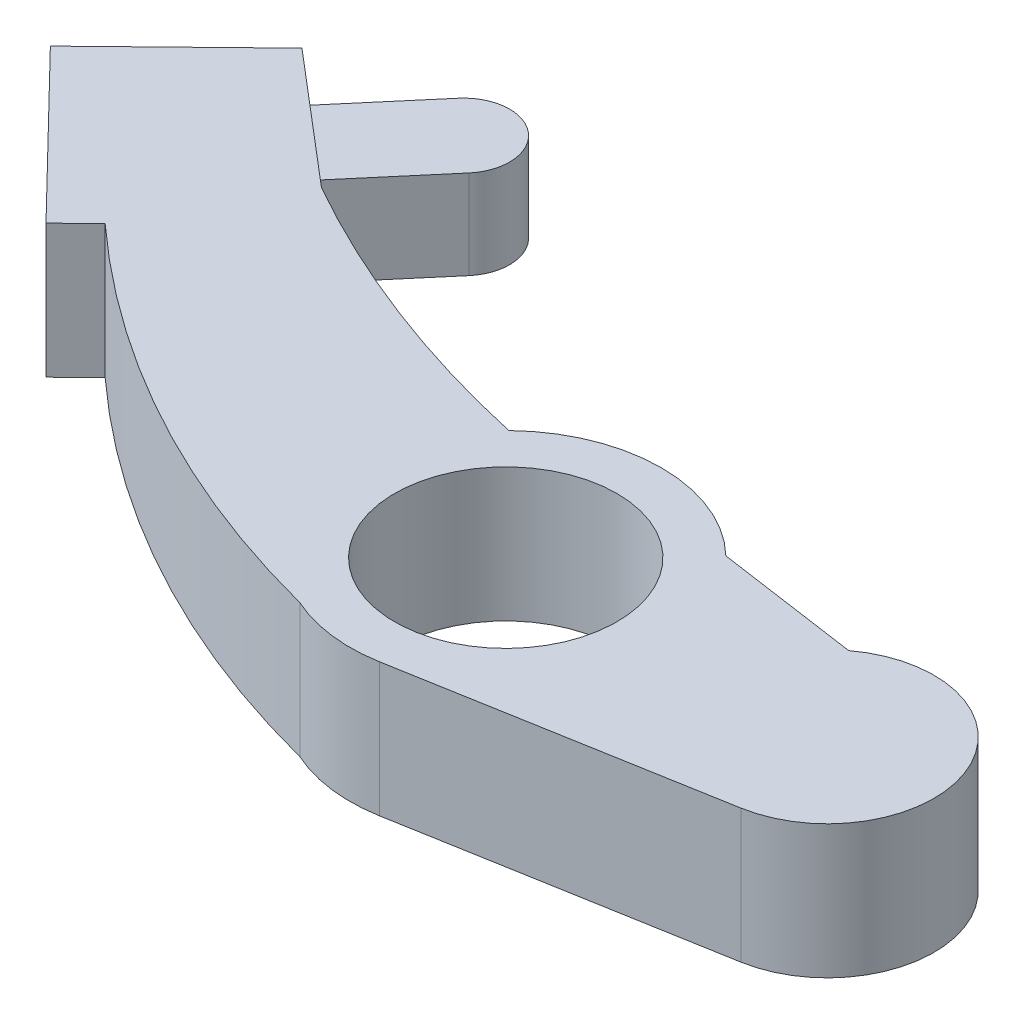
ISO-10303-21;
HEADER;
FILE_DESCRIPTION(('STEP AP214'),'2;1');
FILE_NAME('part.step','',(''),(''),'','','');
FILE_SCHEMA(('AUTOMOTIVE_DESIGN { 1 0 10303 214 1 1 1 1 }'));
ENDSEC;
DATA;
#1=APPLICATION_CONTEXT('core data for automotive mechanical design processes');
#2=APPLICATION_PROTOCOL_DEFINITION('international standard','automotive_design',2000,#1);
#3=PRODUCT_CONTEXT('',#1,'mechanical');
#4=PRODUCT('Part','Part','',(#3));
#5=PRODUCT_RELATED_PRODUCT_CATEGORY('part','',(#4));
#6=PRODUCT_DEFINITION_FORMATION('','',#4);
#7=PRODUCT_DEFINITION_CONTEXT('part definition',#1,'design');
#8=PRODUCT_DEFINITION('design','',#6,#7);
#9=PRODUCT_DEFINITION_SHAPE('','',#8);
#10=(LENGTH_UNIT() NAMED_UNIT(*) SI_UNIT(.MILLI.,.METRE.));
#11=(NAMED_UNIT(*) PLANE_ANGLE_UNIT() SI_UNIT($,.RADIAN.));
#12=(NAMED_UNIT(*) SI_UNIT($,.STERADIAN.) SOLID_ANGLE_UNIT());
#13=UNCERTAINTY_MEASURE_WITH_UNIT(LENGTH_MEASURE(1.E-05),#10,'distance_accuracy_value','');
#14=(GEOMETRIC_REPRESENTATION_CONTEXT(3) GLOBAL_UNCERTAINTY_ASSIGNED_CONTEXT((#13)) GLOBAL_UNIT_ASSIGNED_CONTEXT((#10,
#11,#12)) REPRESENTATION_CONTEXT('',''));
#15=CARTESIAN_POINT('',(0.,0.,0.));
#16=DIRECTION('',(0.,0.,1.));
#17=DIRECTION('',(1.,0.,0.));
#18=AXIS2_PLACEMENT_3D('',#15,#16,#17);
#19=CARTESIAN_POINT('',(-80.3005955568285,72.1470504536898,2.10318678287028));
#20=DIRECTION('',(0.,1.,0.));
#21=DIRECTION('',(0.,0.,1.));
#22=AXIS2_PLACEMENT_3D('',#19,#20,#21);
#23=CYLINDRICAL_SURFACE('',#22,2.58082068089454);
#24=DIRECTION('',(0.,1.,0.));
#25=VECTOR('',#24,1.);
#26=CARTESIAN_POINT('',(-82.2676476872664,74.6470504536898,0.432456013693844));
#27=LINE('',#26,#25);
#28=CARTESIAN_POINT('',(-82.2676476872664,77.1470504536898,0.432456013693844));
#29=VERTEX_POINT('',#28);
#30=CARTESIAN_POINT('',(-82.2676476872664,72.1470504536898,0.432456013693842));
#31=VERTEX_POINT('',#30);
#32=EDGE_CURVE('E116',#29,#31,#27,.F.);
#33=ORIENTED_EDGE('',*,*,#32,.F.);
#34=CARTESIAN_POINT('',(-80.3005955568285,77.1470504536898,2.10318678287028));
#35=DIRECTION('',(0.,1.,0.));
#36=DIRECTION('',(0.,0.,1.));
#37=AXIS2_PLACEMENT_3D('',#34,#35,#36);
#38=CIRCLE('',#37,2.58082068089454);
#39=CARTESIAN_POINT('',(-78.3335434263906,77.1470504536898,3.77391755204672));
#40=VERTEX_POINT('',#39);
#41=EDGE_CURVE('E21',#29,#40,#38,.F.);
#42=ORIENTED_EDGE('',*,*,#41,.T.);
#43=DIRECTION('',(0.,1.,0.));
#44=VECTOR('',#43,1.);
#45=CARTESIAN_POINT('',(-78.3335434263906,74.6470504536898,3.77391755204671));
#46=LINE('',#45,#44);
#47=CARTESIAN_POINT('',(-78.3335434263906,72.1470504536898,3.77391755204672));
#48=VERTEX_POINT('',#47);
#49=EDGE_CURVE('E114',#48,#40,#46,.T.);
#50=ORIENTED_EDGE('',*,*,#49,.F.);
#51=CARTESIAN_POINT('',(-80.3005955568285,72.1470504536898,2.10318678287028));
#52=DIRECTION('',(0.,1.,0.));
#53=DIRECTION('',(0.,0.,1.));
#54=AXIS2_PLACEMENT_3D('',#51,#52,#53);
#55=CIRCLE('',#54,2.58082068089454);
#56=EDGE_CURVE('E117',#48,#31,#55,.T.);
#57=ORIENTED_EDGE('',*,*,#56,.T.);
#58=EDGE_LOOP('',(#33,#42,#50,#57));
#59=FACE_BOUND('',#58,.T.);
#60=ADVANCED_FACE('F17',(#59),#23,.T.);
#61=CARTESIAN_POINT('',(-78.3335434263906,74.6470504536898,3.77391755204671));
#62=DIRECTION('',(0.76218086169243,0.,0.647364143330309));
#63=DIRECTION('',(0.647364143330309,0.,-0.76218086169243));
#64=AXIS2_PLACEMENT_3D('',#61,#62,#63);
#65=PLANE('',#64);
#66=ORIENTED_EDGE('',*,*,#49,.T.);
#67=DIRECTION('',(-0.64736414333031,0.,0.762180861692429));
#68=VECTOR('',#67,1.);
#69=CARTESIAN_POINT('',(-78.3335434263906,77.1470504536898,3.77391755204671));
#70=LINE('',#69,#68);
#71=CARTESIAN_POINT('',(-82.260587690997,77.1470504536898,8.39746368499149));
#72=VERTEX_POINT('',#71);
#73=EDGE_CURVE('E113',#40,#72,#70,.T.);
#74=ORIENTED_EDGE('',*,*,#73,.T.);
#75=DIRECTION('',(0.,1.,0.));
#76=VECTOR('',#75,1.);
#77=CARTESIAN_POINT('',(-82.260587690997,74.6470504536898,8.39746368499149));
#78=LINE('',#77,#76);
#79=CARTESIAN_POINT('',(-82.260587690997,72.1470504536898,8.39746368499149));
#80=VERTEX_POINT('',#79);
#81=EDGE_CURVE('E137',#80,#72,#78,.T.);
#82=ORIENTED_EDGE('',*,*,#81,.F.);
#83=DIRECTION('',(0.64736414333031,0.,-0.762180861692429));
#84=VECTOR('',#83,1.);
#85=CARTESIAN_POINT('',(-82.260587690997,72.1470504536898,8.39746368499148));
#86=LINE('',#85,#84);
#87=EDGE_CURVE('E121',#80,#48,#86,.T.);
#88=ORIENTED_EDGE('',*,*,#87,.T.);
#89=EDGE_LOOP('',(#66,#74,#82,#88));
#90=FACE_BOUND('',#89,.T.);
#91=ADVANCED_FACE('F277',(#90),#65,.T.);
#92=CARTESIAN_POINT('',(-86.451933659426,77.1470504536898,5.35886832844102));
#93=DIRECTION('',(0.,-1.,0.));
#94=DIRECTION('',(0.,0.,-1.));
#95=AXIS2_PLACEMENT_3D('',#92,#93,#94);
#96=PLANE('',#95);
#97=ORIENTED_EDGE('',*,*,#73,.F.);
#98=ORIENTED_EDGE('',*,*,#41,.F.);
#99=DIRECTION('',(-0.647364143330309,0.,0.76218086169243));
#100=VECTOR('',#99,1.);
#101=CARTESIAN_POINT('',(-86.451933659426,77.1470504536898,5.35886832844102));
#102=LINE('',#101,#100);
#103=CARTESIAN_POINT('',(-86.1923684807265,77.1470504536898,5.0532665838823));
#104=VERTEX_POINT('',#103);
#105=EDGE_CURVE('E110',#104,#29,#102,.F.);
#106=ORIENTED_EDGE('',*,*,#105,.F.);
#107=DIRECTION('',(-0.761730535623231,0.,-0.647893965938212));
#108=VECTOR('',#107,1.);
#109=CARTESIAN_POINT('',(-87.8513169704527,77.1470504536898,3.64223910627632));
#110=LINE('',#109,#108);
#111=EDGE_CURVE('E135',#72,#104,#110,.T.);
#112=ORIENTED_EDGE('',*,*,#111,.F.);
#113=EDGE_LOOP('',(#97,#98,#106,#112));
#114=FACE_BOUND('',#113,.T.);
#115=ADVANCED_FACE('F106',(#114),#96,.F.);
#116=CARTESIAN_POINT('',(-86.451933659426,74.6470504536898,5.35886832844102));
#117=DIRECTION('',(-0.76218086169243,0.,-0.647364143330309));
#118=DIRECTION('',(-0.647364143330309,0.,0.76218086169243));
#119=AXIS2_PLACEMENT_3D('',#116,#117,#118);
#120=PLANE('',#119);
#121=ORIENTED_EDGE('',*,*,#32,.T.);
#122=DIRECTION('',(-0.647364143330309,0.,0.76218086169243));
#123=VECTOR('',#122,1.);
#124=CARTESIAN_POINT('',(-82.2676476872664,72.1470504536898,0.432456013693837));
#125=LINE('',#124,#123);
#126=CARTESIAN_POINT('',(-86.1923684807265,72.1470504536898,5.0532665838823));
#127=VERTEX_POINT('',#126);
#128=EDGE_CURVE('E176',#31,#127,#125,.T.);
#129=ORIENTED_EDGE('',*,*,#128,.T.);
#130=DIRECTION('',(0.,1.,0.));
#131=VECTOR('',#130,1.);
#132=CARTESIAN_POINT('',(-86.1923684807265,74.6470504536898,5.05326658388229));
#133=LINE('',#132,#131);
#134=EDGE_CURVE('E125',#104,#127,#133,.F.);
#135=ORIENTED_EDGE('',*,*,#134,.F.);
#136=ORIENTED_EDGE('',*,*,#105,.T.);
#137=EDGE_LOOP('',(#121,#129,#135,#136));
#138=FACE_BOUND('',#137,.T.);
#139=ADVANCED_FACE('F123',(#138),#120,.T.);
#140=CARTESIAN_POINT('',(-82.5178293985503,72.1470504536898,8.7003298667939));
#141=DIRECTION('',(0.,1.,0.));
#142=DIRECTION('',(0.,0.,1.));
#143=AXIS2_PLACEMENT_3D('',#140,#141,#142);
#144=PLANE('',#143);
#145=ORIENTED_EDGE('',*,*,#128,.F.);
#146=ORIENTED_EDGE('',*,*,#56,.F.);
#147=ORIENTED_EDGE('',*,*,#87,.F.);
#148=DIRECTION('',(-0.761730535623231,0.,-0.647893965938212));
#149=VECTOR('',#148,1.);
#150=CARTESIAN_POINT('',(-87.8513169704527,72.1470504536898,3.64223910627632));
#151=LINE('',#150,#149);
#152=EDGE_CURVE('E235',#127,#80,#151,.F.);
#153=ORIENTED_EDGE('',*,*,#152,.F.);
#154=EDGE_LOOP('',(#145,#146,#147,#153));
#155=FACE_BOUND('',#154,.T.);
#156=ADVANCED_FACE('F280',(#155),#144,.F.);
#157=CARTESIAN_POINT('',(-57.3239629900006,78.3970504536898,22.7150767026163));
#158=DIRECTION('',(0.,-1.,0.));
#159=DIRECTION('',(0.,0.,-1.));
#160=AXIS2_PLACEMENT_3D('',#157,#158,#159);
#161=CYLINDRICAL_SURFACE('',#160,6.25);
#162=CARTESIAN_POINT('',(-57.3239629900006,78.3970504536898,22.7150767026163));
#163=DIRECTION('',(0.,-1.,0.));
#164=DIRECTION('',(0.,0.,-1.));
#165=AXIS2_PLACEMENT_3D('',#162,#163,#164);
#166=CIRCLE('',#165,6.25);
#167=CARTESIAN_POINT('',(-57.3239629900006,78.3970504536898,16.4650767026163));
#168=VERTEX_POINT('',#167);
#169=EDGE_CURVE('E155',#168,#168,#166,.F.);
#170=ORIENTED_EDGE('',*,*,#169,.T.);
#171=EDGE_LOOP('',(#170));
#172=FACE_BOUND('',#171,.T.);
#173=CARTESIAN_POINT('',(-57.3239629900006,70.8970504536898,22.7150767026163));
#174=DIRECTION('',(0.,-1.,0.));
#175=DIRECTION('',(0.,0.,-1.));
#176=AXIS2_PLACEMENT_3D('',#173,#174,#175);
#177=CIRCLE('',#176,6.25);
#178=CARTESIAN_POINT('',(-57.3239629900006,70.8970504536898,16.4650767026163));
#179=VERTEX_POINT('',#178);
#180=EDGE_CURVE('E173',#179,#179,#177,.T.);
#181=ORIENTED_EDGE('',*,*,#180,.T.);
#182=EDGE_LOOP('',(#181));
#183=FACE_BOUND('',#182,.T.);
#184=ADVANCED_FACE('F431',(#172,#183),#161,.F.);
#185=CARTESIAN_POINT('',(-46.6395083329408,70.8970504536899,-24.1707853619108));
#186=DIRECTION('',(0.,1.,0.));
#187=DIRECTION('',(-1.,0.,0.));
#188=AXIS2_PLACEMENT_3D('',#185,#186,#187);
#189=CYLINDRICAL_SURFACE('',#188,56.6900441084109);
#190=CARTESIAN_POINT('',(-46.6395083329408,70.8970504536899,-24.1707853619108));
#191=DIRECTION('',(0.,1.,0.));
#192=DIRECTION('',(-1.,0.,0.));
#193=AXIS2_PLACEMENT_3D('',#190,#191,#192);
#194=CIRCLE('',#193,56.6900441084109);
#195=CARTESIAN_POINT('',(-84.8423503979488,70.8970504536899,17.7136265256832));
#196=VERTEX_POINT('',#195);
#197=CARTESIAN_POINT('',(-60.9245176822942,70.8970504536899,30.6899438430721));
#198=VERTEX_POINT('',#197);
#199=EDGE_CURVE('E163',#196,#198,#194,.T.);
#200=ORIENTED_EDGE('',*,*,#199,.T.);
#201=DIRECTION('',(0.,1.,0.));
#202=VECTOR('',#201,1.);
#203=CARTESIAN_POINT('',(-60.9245176822942,74.6470504536898,30.6899438430721));
#204=LINE('',#203,#202);
#205=CARTESIAN_POINT('',(-60.9245176822942,78.3970504536898,30.6899438430721));
#206=VERTEX_POINT('',#205);
#207=EDGE_CURVE('E220',#206,#198,#204,.F.);
#208=ORIENTED_EDGE('',*,*,#207,.F.);
#209=CARTESIAN_POINT('',(-46.6395083329408,78.3970504536898,-24.1707853619108));
#210=DIRECTION('',(0.,1.,0.));
#211=DIRECTION('',(-1.,0.,0.));
#212=AXIS2_PLACEMENT_3D('',#209,#210,#211);
#213=CIRCLE('',#212,56.6900441084109);
#214=CARTESIAN_POINT('',(-84.8423503979488,78.3970504536898,17.7136265256832));
#215=VERTEX_POINT('',#214);
#216=EDGE_CURVE('E152',#206,#215,#213,.F.);
#217=ORIENTED_EDGE('',*,*,#216,.T.);
#218=DIRECTION('',(0.,1.,0.));
#219=VECTOR('',#218,1.);
#220=CARTESIAN_POINT('',(-84.8423503979488,74.6470504536898,17.7136265256832));
#221=LINE('',#220,#219);
#222=EDGE_CURVE('E177',#196,#215,#221,.T.);
#223=ORIENTED_EDGE('',*,*,#222,.F.);
#224=EDGE_LOOP('',(#200,#208,#217,#223));
#225=FACE_BOUND('',#224,.T.);
#226=ADVANCED_FACE('F328',(#225),#189,.T.);
#227=CARTESIAN_POINT('',(-84.8423503979488,74.6470504536898,17.7136265256832));
#228=DIRECTION('',(0.69697673531328,0.,0.717093738943551));
#229=DIRECTION('',(0.717093738943551,0.,-0.69697673531328));
#230=AXIS2_PLACEMENT_3D('',#227,#228,#229);
#231=PLANE('',#230);
#232=DIRECTION('',(0.717093738943549,0.,-0.696976735313283));
#233=VECTOR('',#232,1.);
#234=CARTESIAN_POINT('',(-86.5277224925121,70.8970504536898,19.3517180002893));
#235=LINE('',#234,#233);
#236=CARTESIAN_POINT('',(-86.5277224925121,70.8970504536898,19.3517180002893));
#237=VERTEX_POINT('',#236);
#238=EDGE_CURVE('E165',#237,#196,#235,.T.);
#239=ORIENTED_EDGE('',*,*,#238,.T.);
#240=ORIENTED_EDGE('',*,*,#222,.T.);
#241=DIRECTION('',(-0.717093738943548,0.,0.696976735313284));
#242=VECTOR('',#241,1.);
#243=CARTESIAN_POINT('',(-84.8423503979488,78.3970504536898,17.7136265256832));
#244=LINE('',#243,#242);
#245=CARTESIAN_POINT('',(-86.5277224925121,78.3970504536898,19.3517180002893));
#246=VERTEX_POINT('',#245);
#247=EDGE_CURVE('E154',#215,#246,#244,.T.);
#248=ORIENTED_EDGE('',*,*,#247,.T.);
#249=DIRECTION('',(0.,1.,0.));
#250=VECTOR('',#249,1.);
#251=CARTESIAN_POINT('',(-86.5277224925121,74.6470504536898,19.3517180002893));
#252=LINE('',#251,#250);
#253=EDGE_CURVE('E245',#237,#246,#252,.T.);
#254=ORIENTED_EDGE('',*,*,#253,.F.);
#255=EDGE_LOOP('',(#239,#240,#248,#254));
#256=FACE_BOUND('',#255,.T.);
#257=ADVANCED_FACE('F326',(#256),#231,.T.);
#258=CARTESIAN_POINT('',(-86.5277224925121,74.6470504536898,19.3517180002893));
#259=DIRECTION('',(-0.717093738943551,0.,0.69697673531328));
#260=DIRECTION('',(0.69697673531328,0.,0.717093738943551));
#261=AXIS2_PLACEMENT_3D('',#258,#259,#260);
#262=PLANE('',#261);
#263=DIRECTION('',(0.696976735313281,0.,0.71709373894355));
#264=VECTOR('',#263,1.);
#265=CARTESIAN_POINT('',(-95.0222543598815,70.8970504536898,10.6120064594026));
#266=LINE('',#265,#264);
#267=CARTESIAN_POINT('',(-95.0222543598815,70.8970504536898,10.6120064594026));
#268=VERTEX_POINT('',#267);
#269=EDGE_CURVE('E194',#268,#237,#266,.T.);
#270=ORIENTED_EDGE('',*,*,#269,.T.);
#271=ORIENTED_EDGE('',*,*,#253,.T.);
#272=DIRECTION('',(-0.696976735313281,0.,-0.71709373894355));
#273=VECTOR('',#272,1.);
#274=CARTESIAN_POINT('',(-86.5277224925121,78.3970504536898,19.3517180002893));
#275=LINE('',#274,#273);
#276=CARTESIAN_POINT('',(-95.0222543598815,78.3970504536898,10.6120064594026));
#277=VERTEX_POINT('',#276);
#278=EDGE_CURVE('E210',#246,#277,#275,.T.);
#279=ORIENTED_EDGE('',*,*,#278,.T.);
#280=DIRECTION('',(0.,1.,0.));
#281=VECTOR('',#280,1.);
#282=CARTESIAN_POINT('',(-95.0222543598815,74.6470504536898,10.6120064594026));
#283=LINE('',#282,#281);
#284=EDGE_CURVE('E242',#268,#277,#283,.T.);
#285=ORIENTED_EDGE('',*,*,#284,.F.);
#286=EDGE_LOOP('',(#270,#271,#279,#285));
#287=FACE_BOUND('',#286,.T.);
#288=ADVANCED_FACE('F321',(#287),#262,.T.);
#289=CARTESIAN_POINT('',(-95.0222543598815,74.6470504536898,10.6120064594026));
#290=DIRECTION('',(-0.69697673531328,0.,-0.717093738943551));
#291=DIRECTION('',(-0.717093738943551,0.,0.69697673531328));
#292=AXIS2_PLACEMENT_3D('',#289,#290,#291);
#293=PLANE('',#292);
#294=DIRECTION('',(-0.717093738943551,0.,0.69697673531328));
#295=VECTOR('',#294,1.);
#296=CARTESIAN_POINT('',(-87.8513169704527,70.8970504536898,3.64223910627632));
#297=LINE('',#296,#295);
#298=CARTESIAN_POINT('',(-87.8513169704527,70.8970504536898,3.64223910627632));
#299=VERTEX_POINT('',#298);
#300=EDGE_CURVE('E199',#299,#268,#297,.T.);
#301=ORIENTED_EDGE('',*,*,#300,.T.);
#302=ORIENTED_EDGE('',*,*,#284,.T.);
#303=DIRECTION('',(0.717093738943551,0.,-0.69697673531328));
#304=VECTOR('',#303,1.);
#305=CARTESIAN_POINT('',(-95.0222543598815,78.3970504536898,10.6120064594026));
#306=LINE('',#305,#304);
#307=CARTESIAN_POINT('',(-87.8513169704527,78.3970504536898,3.64223910627632));
#308=VERTEX_POINT('',#307);
#309=EDGE_CURVE('E205',#277,#308,#306,.T.);
#310=ORIENTED_EDGE('',*,*,#309,.T.);
#311=DIRECTION('',(0.,1.,0.));
#312=VECTOR('',#311,1.);
#313=CARTESIAN_POINT('',(-87.8513169704527,74.6470504536898,3.64223910627632));
#314=LINE('',#313,#312);
#315=EDGE_CURVE('E232',#299,#308,#314,.T.);
#316=ORIENTED_EDGE('',*,*,#315,.F.);
#317=EDGE_LOOP('',(#301,#302,#310,#316));
#318=FACE_BOUND('',#317,.T.);
#319=ADVANCED_FACE('F295',(#318),#293,.T.);
#320=CARTESIAN_POINT('',(-87.8513169704527,74.6470504536898,3.64223910627632));
#321=DIRECTION('',(0.647893965938212,0.,-0.761730535623231));
#322=DIRECTION('',(-0.761730535623231,0.,-0.647893965938212));
#323=AXIS2_PLACEMENT_3D('',#320,#321,#322);
#324=PLANE('',#323);
#325=DIRECTION('',(-0.761730535623232,0.,-0.647893965938212));
#326=VECTOR('',#325,1.);
#327=CARTESIAN_POINT('',(-80.5123124576237,70.8970504536898,9.88446850038207));
#328=LINE('',#327,#326);
#329=CARTESIAN_POINT('',(-80.5123124576237,70.8970504536898,9.88446850038208));
#330=VERTEX_POINT('',#329);
#331=EDGE_CURVE('E169',#330,#299,#328,.T.);
#332=ORIENTED_EDGE('',*,*,#331,.T.);
#333=ORIENTED_EDGE('',*,*,#315,.T.);
#334=DIRECTION('',(0.761730535623232,0.,0.647893965938212));
#335=VECTOR('',#334,1.);
#336=CARTESIAN_POINT('',(-87.8513169704527,78.3970504536898,3.64223910627632));
#337=LINE('',#336,#335);
#338=CARTESIAN_POINT('',(-80.5123124576237,78.3970504536899,9.88446850038208));
#339=VERTEX_POINT('',#338);
#340=EDGE_CURVE('E151',#308,#339,#337,.T.);
#341=ORIENTED_EDGE('',*,*,#340,.T.);
#342=DIRECTION('',(0.,1.,0.));
#343=VECTOR('',#342,1.);
#344=CARTESIAN_POINT('',(-80.5123124576237,74.6470504536898,9.88446850038208));
#345=LINE('',#344,#343);
#346=EDGE_CURVE('E229',#330,#339,#345,.T.);
#347=ORIENTED_EDGE('',*,*,#346,.F.);
#348=EDGE_LOOP('',(#332,#333,#341,#347));
#349=FACE_BOUND('',#348,.T.);
#350=ORIENTED_EDGE('',*,*,#134,.T.);
#351=ORIENTED_EDGE('',*,*,#152,.T.);
#352=ORIENTED_EDGE('',*,*,#81,.T.);
#353=ORIENTED_EDGE('',*,*,#111,.T.);
#354=EDGE_LOOP('',(#350,#351,#352,#353));
#355=FACE_BOUND('',#354,.T.);
#356=ADVANCED_FACE('F275',(#349,#355),#324,.T.);
#357=CARTESIAN_POINT('',(-50.1183535752966,70.8970504536899,-43.7920462684459));
#358=DIRECTION('',(0.,1.,0.));
#359=DIRECTION('',(-1.,0.,0.));
#360=AXIS2_PLACEMENT_3D('',#357,#358,#359);
#361=CYLINDRICAL_SURFACE('',#360,61.6843657199196);
#362=CARTESIAN_POINT('',(-50.1183535752966,70.8970504536898,-43.7920462684459));
#363=DIRECTION('',(0.,1.,0.));
#364=DIRECTION('',(-1.,0.,0.));
#365=AXIS2_PLACEMENT_3D('',#362,#363,#364);
#366=CIRCLE('',#365,61.6843657199196);
#367=CARTESIAN_POINT('',(-63.4225094239999,70.8970504536898,16.4405064868725));
#368=VERTEX_POINT('',#367);
#369=EDGE_CURVE('E166',#368,#330,#366,.F.);
#370=ORIENTED_EDGE('',*,*,#369,.T.);
#371=ORIENTED_EDGE('',*,*,#346,.T.);
#372=CARTESIAN_POINT('',(-50.1183535752966,78.3970504536899,-43.7920462684459));
#373=DIRECTION('',(0.,1.,0.));
#374=DIRECTION('',(-1.,0.,0.));
#375=AXIS2_PLACEMENT_3D('',#372,#373,#374);
#376=CIRCLE('',#375,61.6843657199196);
#377=CARTESIAN_POINT('',(-63.4225094239999,78.3970504536899,16.4405064868725));
#378=VERTEX_POINT('',#377);
#379=EDGE_CURVE('E149',#339,#378,#376,.T.);
#380=ORIENTED_EDGE('',*,*,#379,.T.);
#381=DIRECTION('',(0.,1.,0.));
#382=VECTOR('',#381,1.);
#383=CARTESIAN_POINT('',(-63.4225094239999,74.6470504536898,16.4405064868725));
#384=LINE('',#383,#382);
#385=EDGE_CURVE('E223',#368,#378,#384,.T.);
#386=ORIENTED_EDGE('',*,*,#385,.F.);
#387=EDGE_LOOP('',(#370,#371,#380,#386));
#388=FACE_BOUND('',#387,.T.);
#389=ADVANCED_FACE('F308',(#388),#361,.F.);
#390=CARTESIAN_POINT('',(-57.3239629900041,70.8970504536898,22.715076702623));
#391=DIRECTION('',(0.,1.,0.));
#392=DIRECTION('',(0.,0.,1.));
#393=AXIS2_PLACEMENT_3D('',#390,#391,#392);
#394=CYLINDRICAL_SURFACE('',#393,8.74999999999927);
#395=CARTESIAN_POINT('',(-57.3239629900041,70.8970504536898,22.715076702623));
#396=DIRECTION('',(0.,1.,0.));
#397=DIRECTION('',(0.,0.,1.));
#398=AXIS2_PLACEMENT_3D('',#395,#396,#397);
#399=CIRCLE('',#398,8.74999999999927);
#400=CARTESIAN_POINT('',(-51.2230933052845,70.8970504536898,16.4427653989601));
#401=VERTEX_POINT('',#400);
#402=EDGE_CURVE('E170',#401,#368,#399,.T.);
#403=ORIENTED_EDGE('',*,*,#402,.T.);
#404=ORIENTED_EDGE('',*,*,#385,.T.);
#405=CARTESIAN_POINT('',(-57.3239629900041,78.3970504536898,22.715076702623));
#406=DIRECTION('',(0.,1.,0.));
#407=DIRECTION('',(0.,0.,1.));
#408=AXIS2_PLACEMENT_3D('',#405,#406,#407);
#409=CIRCLE('',#408,8.74999999999927);
#410=CARTESIAN_POINT('',(-51.2230933052845,78.3970504536898,16.4427653989601));
#411=VERTEX_POINT('',#410);
#412=EDGE_CURVE('E147',#378,#411,#409,.F.);
#413=ORIENTED_EDGE('',*,*,#412,.T.);
#414=DIRECTION('',(0.,1.,0.));
#415=VECTOR('',#414,1.);
#416=CARTESIAN_POINT('',(-51.2230933052845,74.6470504536898,16.4427653989601));
#417=LINE('',#416,#415);
#418=EDGE_CURVE('E158',#401,#411,#417,.T.);
#419=ORIENTED_EDGE('',*,*,#418,.F.);
#420=EDGE_LOOP('',(#403,#404,#413,#419));
#421=FACE_BOUND('',#420,.T.);
#422=ADVANCED_FACE('F310',(#421),#394,.T.);
#423=CARTESIAN_POINT('',(-38.5252970009941,74.6470504536898,28.2957265637091));
#424=DIRECTION('',(0.173074471085876,0.,0.984908740675168));
#425=DIRECTION('',(0.984908740675168,0.,-0.173074471085876));
#426=AXIS2_PLACEMENT_3D('',#423,#424,#425);
#427=PLANE('',#426);
#428=DIRECTION('',(0.984908740675168,0.,-0.173074471085873));
#429=VECTOR('',#428,1.);
#430=CARTESIAN_POINT('',(-55.8095613680028,70.8970504536898,31.3330281835299));
#431=LINE('',#430,#429);
#432=CARTESIAN_POINT('',(-55.8095613680028,70.8970504536898,31.33302818353));
#433=VERTEX_POINT('',#432);
#434=CARTESIAN_POINT('',(-38.5252970009941,70.8970504536898,28.295726563709));
#435=VERTEX_POINT('',#434);
#436=EDGE_CURVE('E162',#433,#435,#431,.T.);
#437=ORIENTED_EDGE('',*,*,#436,.T.);
#438=DIRECTION('',(0.,1.,0.));
#439=VECTOR('',#438,1.);
#440=CARTESIAN_POINT('',(-38.5252970009941,74.6470504536898,28.295726563709));
#441=LINE('',#440,#439);
#442=CARTESIAN_POINT('',(-38.5252970009941,78.3970504536898,28.295726563709));
#443=VERTEX_POINT('',#442);
#444=EDGE_CURVE('E175',#443,#435,#441,.F.);
#445=ORIENTED_EDGE('',*,*,#444,.F.);
#446=DIRECTION('',(-0.984908740675168,0.,0.173074471085873));
#447=VECTOR('',#446,1.);
#448=CARTESIAN_POINT('',(-38.5252970009941,78.3970504536898,28.2957265637091));
#449=LINE('',#448,#447);
#450=CARTESIAN_POINT('',(-55.8095613680028,78.3970504536898,31.33302818353));
#451=VERTEX_POINT('',#450);
#452=EDGE_CURVE('E146',#443,#451,#449,.T.);
#453=ORIENTED_EDGE('',*,*,#452,.T.);
#454=DIRECTION('',(0.,1.,0.));
#455=VECTOR('',#454,1.);
#456=CARTESIAN_POINT('',(-55.8095613680028,74.6470504536898,31.33302818353));
#457=LINE('',#456,#455);
#458=EDGE_CURVE('E217',#433,#451,#457,.T.);
#459=ORIENTED_EDGE('',*,*,#458,.F.);
#460=EDGE_LOOP('',(#437,#445,#453,#459));
#461=FACE_BOUND('',#460,.T.);
#462=ADVANCED_FACE('F334',(#461),#427,.T.);
#463=CARTESIAN_POINT('',(-57.3239629900041,70.8970504536898,22.715076702623));
#464=DIRECTION('',(0.,1.,0.));
#465=DIRECTION('',(0.,0.,1.));
#466=AXIS2_PLACEMENT_3D('',#463,#464,#465);
#467=CYLINDRICAL_SURFACE('',#466,8.74999999999927);
#468=CARTESIAN_POINT('',(-57.3239629900041,70.8970504536898,22.715076702623));
#469=DIRECTION('',(0.,1.,0.));
#470=DIRECTION('',(0.,0.,1.));
#471=AXIS2_PLACEMENT_3D('',#468,#469,#470);
#472=CIRCLE('',#471,8.74999999999927);
#473=EDGE_CURVE('E159',#198,#433,#472,.T.);
#474=ORIENTED_EDGE('',*,*,#473,.T.);
#475=ORIENTED_EDGE('',*,*,#458,.T.);
#476=CARTESIAN_POINT('',(-57.3239629900041,78.3970504536898,22.715076702623));
#477=DIRECTION('',(0.,1.,0.));
#478=DIRECTION('',(0.,0.,1.));
#479=AXIS2_PLACEMENT_3D('',#476,#477,#478);
#480=CIRCLE('',#479,8.74999999999927);
#481=EDGE_CURVE('E143',#451,#206,#480,.F.);
#482=ORIENTED_EDGE('',*,*,#481,.T.);
#483=ORIENTED_EDGE('',*,*,#207,.T.);
#484=EDGE_LOOP('',(#474,#475,#482,#483));
#485=FACE_BOUND('',#484,.T.);
#486=ADVANCED_FACE('F331',(#485),#467,.T.);
#487=CARTESIAN_POINT('',(-38.5252970009941,70.8970504536898,28.2957265637091));
#488=DIRECTION('',(0.,1.,0.));
#489=DIRECTION('',(0.,0.,1.));
#490=AXIS2_PLACEMENT_3D('',#487,#488,#489);
#491=PLANE('',#490);
#492=ORIENTED_EDGE('',*,*,#436,.F.);
#493=ORIENTED_EDGE('',*,*,#473,.F.);
#494=ORIENTED_EDGE('',*,*,#199,.F.);
#495=ORIENTED_EDGE('',*,*,#238,.F.);
#496=ORIENTED_EDGE('',*,*,#269,.F.);
#497=ORIENTED_EDGE('',*,*,#300,.F.);
#498=ORIENTED_EDGE('',*,*,#331,.F.);
#499=ORIENTED_EDGE('',*,*,#369,.F.);
#500=ORIENTED_EDGE('',*,*,#402,.F.);
#501=DIRECTION('',(-0.989830469353456,0.,-0.142252036679684));
#502=VECTOR('',#501,1.);
#503=CARTESIAN_POINT('',(-51.2230933052845,70.8970504536898,16.4427653989601));
#504=LINE('',#503,#502);
#505=CARTESIAN_POINT('',(-43.1616035841988,70.8970504536898,17.6013105912957));
#506=VERTEX_POINT('',#505);
#507=EDGE_CURVE('E191',#506,#401,#504,.T.);
#508=ORIENTED_EDGE('',*,*,#507,.F.);
#509=CARTESIAN_POINT('',(-39.5625259476581,70.8970504536898,22.3932046652379));
#510=DIRECTION('',(0.,1.,0.));
#511=DIRECTION('',(0.,0.,1.));
#512=AXIS2_PLACEMENT_3D('',#509,#510,#511);
#513=CIRCLE('',#512,5.99296326116964);
#514=EDGE_CURVE('E140',#435,#506,#513,.T.);
#515=ORIENTED_EDGE('',*,*,#514,.F.);
#516=EDGE_LOOP('',(#492,#493,#494,#495,#496,#497,#498,#499,#500,#508,#515));
#517=FACE_BOUND('',#516,.T.);
#518=ORIENTED_EDGE('',*,*,#180,.F.);
#519=EDGE_LOOP('',(#518));
#520=FACE_BOUND('',#519,.T.);
#521=ADVANCED_FACE('F315',(#517,#520),#491,.F.);
#522=CARTESIAN_POINT('',(-51.2230933052845,74.6470504536898,16.4427653989601));
#523=DIRECTION('',(0.142252036679684,0.,-0.989830469353456));
#524=DIRECTION('',(-0.989830469353456,0.,-0.142252036679684));
#525=AXIS2_PLACEMENT_3D('',#522,#523,#524);
#526=PLANE('',#525);
#527=ORIENTED_EDGE('',*,*,#507,.T.);
#528=ORIENTED_EDGE('',*,*,#418,.T.);
#529=DIRECTION('',(0.989830469353456,0.,0.142252036679684));
#530=VECTOR('',#529,1.);
#531=CARTESIAN_POINT('',(-51.2230933052845,78.3970504536898,16.4427653989601));
#532=LINE('',#531,#530);
#533=CARTESIAN_POINT('',(-43.1616035841988,78.3970504536898,17.6013105912957));
#534=VERTEX_POINT('',#533);
#535=EDGE_CURVE('E36',#411,#534,#532,.T.);
#536=ORIENTED_EDGE('',*,*,#535,.T.);
#537=DIRECTION('',(0.,1.,0.));
#538=VECTOR('',#537,1.);
#539=CARTESIAN_POINT('',(-43.1616035841988,74.6470504536898,17.6013105912957));
#540=LINE('',#539,#538);
#541=EDGE_CURVE('E27',#506,#534,#540,.T.);
#542=ORIENTED_EDGE('',*,*,#541,.F.);
#543=EDGE_LOOP('',(#527,#528,#536,#542));
#544=FACE_BOUND('',#543,.T.);
#545=ADVANCED_FACE('F336',(#544),#526,.T.);
#546=CARTESIAN_POINT('',(-55.8095613680028,78.3970504536898,31.3330281835299));
#547=DIRECTION('',(0.,-1.,0.));
#548=DIRECTION('',(0.,0.,-1.));
#549=AXIS2_PLACEMENT_3D('',#546,#547,#548);
#550=PLANE('',#549);
#551=ORIENTED_EDGE('',*,*,#452,.F.);
#552=CARTESIAN_POINT('',(-39.5625259476581,78.3970504536898,22.3932046652379));
#553=DIRECTION('',(0.,1.,0.));
#554=DIRECTION('',(0.,0.,1.));
#555=AXIS2_PLACEMENT_3D('',#552,#553,#554);
#556=CIRCLE('',#555,5.99296326116964);
#557=EDGE_CURVE('E11',#534,#443,#556,.F.);
#558=ORIENTED_EDGE('',*,*,#557,.F.);
#559=ORIENTED_EDGE('',*,*,#535,.F.);
#560=ORIENTED_EDGE('',*,*,#412,.F.);
#561=ORIENTED_EDGE('',*,*,#379,.F.);
#562=ORIENTED_EDGE('',*,*,#340,.F.);
#563=ORIENTED_EDGE('',*,*,#309,.F.);
#564=ORIENTED_EDGE('',*,*,#278,.F.);
#565=ORIENTED_EDGE('',*,*,#247,.F.);
#566=ORIENTED_EDGE('',*,*,#216,.F.);
#567=ORIENTED_EDGE('',*,*,#481,.F.);
#568=EDGE_LOOP('',(#551,#558,#559,#560,#561,#562,#563,#564,#565,#566,#567));
#569=FACE_BOUND('',#568,.T.);
#570=ORIENTED_EDGE('',*,*,#169,.F.);
#571=EDGE_LOOP('',(#570));
#572=FACE_BOUND('',#571,.T.);
#573=ADVANCED_FACE('F304',(#569,#572),#550,.F.);
#574=CARTESIAN_POINT('',(-39.5625259476581,70.8970504536898,22.3932046652379));
#575=DIRECTION('',(0.,1.,0.));
#576=DIRECTION('',(0.,0.,1.));
#577=AXIS2_PLACEMENT_3D('',#574,#575,#576);
#578=CYLINDRICAL_SURFACE('',#577,5.99296326116964);
#579=ORIENTED_EDGE('',*,*,#541,.T.);
#580=ORIENTED_EDGE('',*,*,#557,.T.);
#581=ORIENTED_EDGE('',*,*,#444,.T.);
#582=ORIENTED_EDGE('',*,*,#514,.T.);
#583=EDGE_LOOP('',(#579,#580,#581,#582));
#584=FACE_BOUND('',#583,.T.);
#585=ADVANCED_FACE('F19',(#584),#578,.T.);
#586=CLOSED_SHELL('',(#60,#91,#115,#139,#156,#184,#226,#257,#288,#319,#356,#389,#422,#462,#486,
#521,#545,#573,#585));
#587=MANIFOLD_SOLID_BREP('B1',#586);
#588=ADVANCED_BREP_SHAPE_REPRESENTATION('',(#18,#587),#14);
#589=SHAPE_DEFINITION_REPRESENTATION(#9,#588);
ENDSEC;
END-ISO-10303-21;
